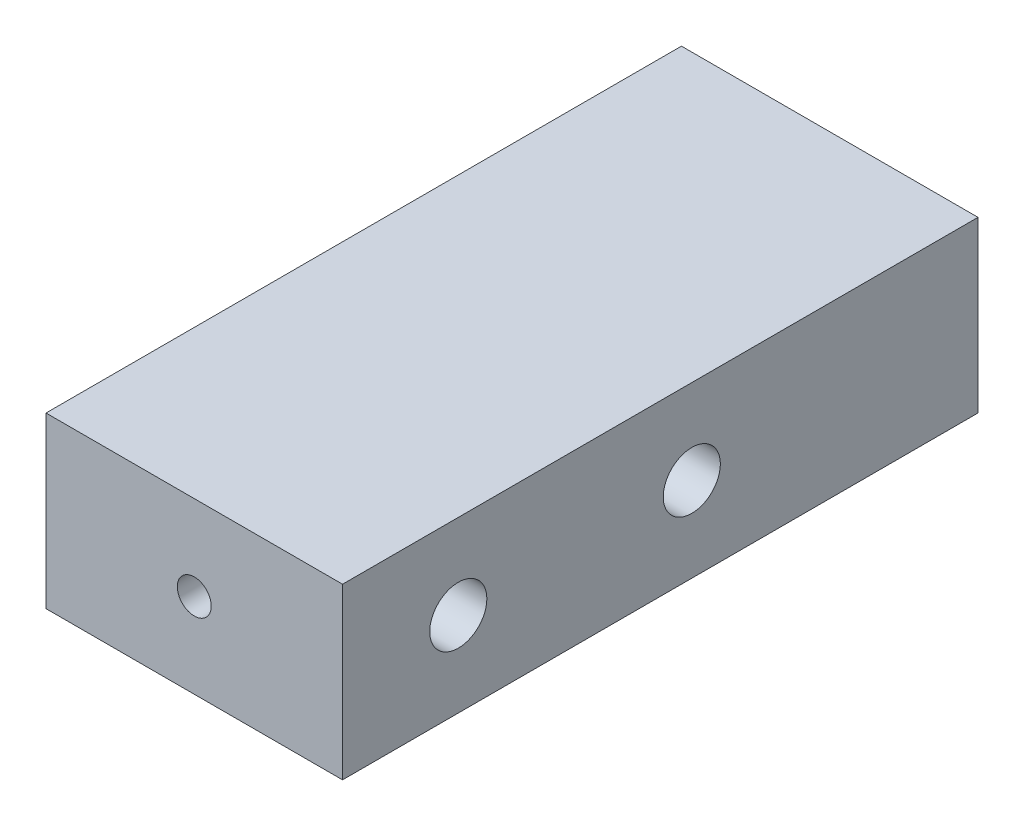
ISO-10303-21;
HEADER;
FILE_DESCRIPTION(('STEP AP214'),'2;1');
FILE_NAME('part.step','',(''),(''),'','','');
FILE_SCHEMA(('AUTOMOTIVE_DESIGN { 1 0 10303 214 1 1 1 1 }'));
ENDSEC;
DATA;
#1=APPLICATION_CONTEXT('core data for automotive mechanical design processes');
#2=APPLICATION_PROTOCOL_DEFINITION('international standard','automotive_design',2000,#1);
#3=PRODUCT_CONTEXT('',#1,'mechanical');
#4=PRODUCT('Part','Part','',(#3));
#5=PRODUCT_RELATED_PRODUCT_CATEGORY('part','',(#4));
#6=PRODUCT_DEFINITION_FORMATION('','',#4);
#7=PRODUCT_DEFINITION_CONTEXT('part definition',#1,'design');
#8=PRODUCT_DEFINITION('design','',#6,#7);
#9=PRODUCT_DEFINITION_SHAPE('','',#8);
#10=(LENGTH_UNIT() NAMED_UNIT(*) SI_UNIT(.MILLI.,.METRE.));
#11=(NAMED_UNIT(*) PLANE_ANGLE_UNIT() SI_UNIT($,.RADIAN.));
#12=(NAMED_UNIT(*) SI_UNIT($,.STERADIAN.) SOLID_ANGLE_UNIT());
#13=UNCERTAINTY_MEASURE_WITH_UNIT(LENGTH_MEASURE(1.E-05),#10,'distance_accuracy_value','');
#14=(GEOMETRIC_REPRESENTATION_CONTEXT(3) GLOBAL_UNCERTAINTY_ASSIGNED_CONTEXT((#13)) GLOBAL_UNIT_ASSIGNED_CONTEXT((#10,
#11,#12)) REPRESENTATION_CONTEXT('',''));
#15=CARTESIAN_POINT('',(0.,0.,0.));
#16=DIRECTION('',(0.,0.,1.));
#17=DIRECTION('',(1.,0.,0.));
#18=AXIS2_PLACEMENT_3D('',#15,#16,#17);
#19=CARTESIAN_POINT('',(0.,25.4,95.25));
#20=DIRECTION('',(1.,0.,0.));
#21=DIRECTION('',(0.,0.,-1.));
#22=AXIS2_PLACEMENT_3D('',#19,#20,#21);
#23=PLANE('',#22);
#24=CARTESIAN_POINT('',(0.,12.7,25.4));
#25=DIRECTION('',(-1.,0.,0.));
#26=DIRECTION('',(0.,-1.,0.));
#27=AXIS2_PLACEMENT_3D('',#24,#25,#26);
#28=CIRCLE('',#27,4.28);
#29=CARTESIAN_POINT('',(0.,8.42,25.4));
#30=VERTEX_POINT('',#29);
#31=EDGE_CURVE('E159',#30,#30,#28,.T.);
#32=ORIENTED_EDGE('',*,*,#31,.F.);
#33=EDGE_LOOP('',(#32));
#34=FACE_BOUND('',#33,.T.);
#35=CARTESIAN_POINT('',(0.,12.7,60.4));
#36=DIRECTION('',(-1.,0.,0.));
#37=DIRECTION('',(0.,-1.,0.));
#38=AXIS2_PLACEMENT_3D('',#35,#36,#37);
#39=CIRCLE('',#38,4.28000000000001);
#40=CARTESIAN_POINT('',(0.,8.41999999999999,60.4));
#41=VERTEX_POINT('',#40);
#42=EDGE_CURVE('E162',#41,#41,#39,.T.);
#43=ORIENTED_EDGE('',*,*,#42,.F.);
#44=EDGE_LOOP('',(#43));
#45=FACE_BOUND('',#44,.T.);
#46=DIRECTION('',(0.,-1.,0.));
#47=VECTOR('',#46,1.);
#48=CARTESIAN_POINT('',(0.,25.4,0.));
#49=LINE('',#48,#47);
#50=CARTESIAN_POINT('',(0.,25.4,0.));
#51=VERTEX_POINT('',#50);
#52=CARTESIAN_POINT('',(0.,0.,0.));
#53=VERTEX_POINT('',#52);
#54=EDGE_CURVE('E158',#51,#53,#49,.T.);
#55=ORIENTED_EDGE('',*,*,#54,.T.);
#56=DIRECTION('',(0.,0.,-1.));
#57=VECTOR('',#56,1.);
#58=CARTESIAN_POINT('',(0.,0.,95.25));
#59=LINE('',#58,#57);
#60=CARTESIAN_POINT('',(0.,0.,95.25));
#61=VERTEX_POINT('',#60);
#62=EDGE_CURVE('E11',#61,#53,#59,.T.);
#63=ORIENTED_EDGE('',*,*,#62,.F.);
#64=DIRECTION('',(0.,-1.,0.));
#65=VECTOR('',#64,1.);
#66=CARTESIAN_POINT('',(0.,25.4,95.25));
#67=LINE('',#66,#65);
#68=CARTESIAN_POINT('',(0.,25.4,95.25));
#69=VERTEX_POINT('',#68);
#70=EDGE_CURVE('E167',#69,#61,#67,.T.);
#71=ORIENTED_EDGE('',*,*,#70,.F.);
#72=DIRECTION('',(0.,0.,-1.));
#73=VECTOR('',#72,1.);
#74=CARTESIAN_POINT('',(0.,25.4,95.25));
#75=LINE('',#74,#73);
#76=EDGE_CURVE('E177',#69,#51,#75,.T.);
#77=ORIENTED_EDGE('',*,*,#76,.T.);
#78=EDGE_LOOP('',(#55,#63,#71,#77));
#79=FACE_BOUND('',#78,.T.);
#80=ADVANCED_FACE('F39',(#34,#45,#79),#23,.F.);
#81=CARTESIAN_POINT('',(0.,0.,95.25));
#82=DIRECTION('',(0.,1.,0.));
#83=DIRECTION('',(0.,0.,1.));
#84=AXIS2_PLACEMENT_3D('',#81,#82,#83);
#85=PLANE('',#84);
#86=DIRECTION('',(1.,0.,0.));
#87=VECTOR('',#86,1.);
#88=CARTESIAN_POINT('',(0.,0.,0.));
#89=LINE('',#88,#87);
#90=CARTESIAN_POINT('',(44.45,0.,0.));
#91=VERTEX_POINT('',#90);
#92=EDGE_CURVE('E180',#53,#91,#89,.T.);
#93=ORIENTED_EDGE('',*,*,#92,.T.);
#94=DIRECTION('',(0.,0.,-1.));
#95=VECTOR('',#94,1.);
#96=CARTESIAN_POINT('',(44.45,0.,95.25));
#97=LINE('',#96,#95);
#98=CARTESIAN_POINT('',(44.45,0.,95.25));
#99=VERTEX_POINT('',#98);
#100=EDGE_CURVE('E47',#99,#91,#97,.T.);
#101=ORIENTED_EDGE('',*,*,#100,.F.);
#102=DIRECTION('',(1.,0.,0.));
#103=VECTOR('',#102,1.);
#104=CARTESIAN_POINT('',(0.,0.,95.25));
#105=LINE('',#104,#103);
#106=EDGE_CURVE('E170',#61,#99,#105,.T.);
#107=ORIENTED_EDGE('',*,*,#106,.F.);
#108=ORIENTED_EDGE('',*,*,#62,.T.);
#109=EDGE_LOOP('',(#93,#101,#107,#108));
#110=FACE_BOUND('',#109,.T.);
#111=ADVANCED_FACE('F211',(#110),#85,.F.);
#112=CARTESIAN_POINT('',(44.45,25.4,95.25));
#113=DIRECTION('',(-1.,0.,0.));
#114=DIRECTION('',(0.,0.,1.));
#115=AXIS2_PLACEMENT_3D('',#112,#113,#114);
#116=PLANE('',#115);
#117=CARTESIAN_POINT('',(44.45,12.7,77.9));
#118=DIRECTION('',(1.,0.,0.));
#119=DIRECTION('',(0.,0.,-1.));
#120=AXIS2_PLACEMENT_3D('',#117,#118,#119);
#121=CIRCLE('',#120,4.28000000000001);
#122=CARTESIAN_POINT('',(44.45,12.7,73.62));
#123=VERTEX_POINT('',#122);
#124=EDGE_CURVE('E147',#123,#123,#121,.T.);
#125=ORIENTED_EDGE('',*,*,#124,.F.);
#126=EDGE_LOOP('',(#125));
#127=FACE_BOUND('',#126,.T.);
#128=CARTESIAN_POINT('',(44.45,12.7,42.9));
#129=DIRECTION('',(1.,0.,0.));
#130=DIRECTION('',(0.,0.,-1.));
#131=AXIS2_PLACEMENT_3D('',#128,#129,#130);
#132=CIRCLE('',#131,4.28);
#133=CARTESIAN_POINT('',(44.45,12.7,38.62));
#134=VERTEX_POINT('',#133);
#135=EDGE_CURVE('E150',#134,#134,#132,.T.);
#136=ORIENTED_EDGE('',*,*,#135,.F.);
#137=EDGE_LOOP('',(#136));
#138=FACE_BOUND('',#137,.T.);
#139=DIRECTION('',(0.,1.,0.));
#140=VECTOR('',#139,1.);
#141=CARTESIAN_POINT('',(44.45,25.4,0.));
#142=LINE('',#141,#140);
#143=CARTESIAN_POINT('',(44.45,25.4,0.));
#144=VERTEX_POINT('',#143);
#145=EDGE_CURVE('E182',#91,#144,#142,.T.);
#146=ORIENTED_EDGE('',*,*,#145,.T.);
#147=DIRECTION('',(0.,0.,-1.));
#148=VECTOR('',#147,1.);
#149=CARTESIAN_POINT('',(44.45,25.4,95.25));
#150=LINE('',#149,#148);
#151=CARTESIAN_POINT('',(44.45,25.4,95.25));
#152=VERTEX_POINT('',#151);
#153=EDGE_CURVE('E187',#152,#144,#150,.T.);
#154=ORIENTED_EDGE('',*,*,#153,.F.);
#155=DIRECTION('',(0.,1.,0.));
#156=VECTOR('',#155,1.);
#157=CARTESIAN_POINT('',(44.45,25.4,95.25));
#158=LINE('',#157,#156);
#159=EDGE_CURVE('E173',#99,#152,#158,.T.);
#160=ORIENTED_EDGE('',*,*,#159,.F.);
#161=ORIENTED_EDGE('',*,*,#100,.T.);
#162=EDGE_LOOP('',(#146,#154,#160,#161));
#163=FACE_BOUND('',#162,.T.);
#164=ADVANCED_FACE('F195',(#127,#138,#163),#116,.F.);
#165=CARTESIAN_POINT('',(0.,25.4,95.25));
#166=DIRECTION('',(0.,-1.,0.));
#167=DIRECTION('',(0.,0.,-1.));
#168=AXIS2_PLACEMENT_3D('',#165,#166,#167);
#169=PLANE('',#168);
#170=DIRECTION('',(-1.,0.,0.));
#171=VECTOR('',#170,1.);
#172=CARTESIAN_POINT('',(0.,25.4,0.));
#173=LINE('',#172,#171);
#174=EDGE_CURVE('E171',#144,#51,#173,.T.);
#175=ORIENTED_EDGE('',*,*,#174,.T.);
#176=ORIENTED_EDGE('',*,*,#76,.F.);
#177=DIRECTION('',(-1.,0.,0.));
#178=VECTOR('',#177,1.);
#179=CARTESIAN_POINT('',(0.,25.4,95.25));
#180=LINE('',#179,#178);
#181=EDGE_CURVE('E175',#152,#69,#180,.T.);
#182=ORIENTED_EDGE('',*,*,#181,.F.);
#183=ORIENTED_EDGE('',*,*,#153,.T.);
#184=EDGE_LOOP('',(#175,#176,#182,#183));
#185=FACE_BOUND('',#184,.T.);
#186=ADVANCED_FACE('F204',(#185),#169,.F.);
#187=CARTESIAN_POINT('',(0.,0.,95.25));
#188=DIRECTION('',(0.,0.,1.));
#189=DIRECTION('',(1.,0.,0.));
#190=AXIS2_PLACEMENT_3D('',#187,#188,#189);
#191=PLANE('',#190);
#192=CARTESIAN_POINT('',(22.225,12.7,95.25));
#193=DIRECTION('',(0.,0.,1.));
#194=DIRECTION('',(1.,0.,0.));
#195=AXIS2_PLACEMENT_3D('',#192,#193,#194);
#196=CIRCLE('',#195,2.54);
#197=CARTESIAN_POINT('',(24.765,12.7,95.25));
#198=VERTEX_POINT('',#197);
#199=EDGE_CURVE('E42',#198,#198,#196,.T.);
#200=ORIENTED_EDGE('',*,*,#199,.F.);
#201=EDGE_LOOP('',(#200));
#202=FACE_BOUND('',#201,.T.);
#203=ORIENTED_EDGE('',*,*,#70,.T.);
#204=ORIENTED_EDGE('',*,*,#106,.T.);
#205=ORIENTED_EDGE('',*,*,#159,.T.);
#206=ORIENTED_EDGE('',*,*,#181,.T.);
#207=EDGE_LOOP('',(#203,#204,#205,#206));
#208=FACE_BOUND('',#207,.T.);
#209=ADVANCED_FACE('F210',(#202,#208),#191,.T.);
#210=CARTESIAN_POINT('',(0.,0.,0.));
#211=DIRECTION('',(0.,0.,1.));
#212=DIRECTION('',(1.,0.,0.));
#213=AXIS2_PLACEMENT_3D('',#210,#211,#212);
#214=PLANE('',#213);
#215=CARTESIAN_POINT('',(22.225,12.7,0.));
#216=DIRECTION('',(0.,0.,-1.));
#217=DIRECTION('',(-1.,0.,0.));
#218=AXIS2_PLACEMENT_3D('',#215,#216,#217);
#219=CIRCLE('',#218,4.2799);
#220=CARTESIAN_POINT('',(17.9451,12.7,0.));
#221=VERTEX_POINT('',#220);
#222=EDGE_CURVE('E140',#221,#221,#219,.T.);
#223=ORIENTED_EDGE('',*,*,#222,.F.);
#224=EDGE_LOOP('',(#223));
#225=FACE_BOUND('',#224,.T.);
#226=ORIENTED_EDGE('',*,*,#54,.F.);
#227=ORIENTED_EDGE('',*,*,#174,.F.);
#228=ORIENTED_EDGE('',*,*,#145,.F.);
#229=ORIENTED_EDGE('',*,*,#92,.F.);
#230=EDGE_LOOP('',(#226,#227,#228,#229));
#231=FACE_BOUND('',#230,.T.);
#232=ADVANCED_FACE('F201',(#225,#231),#214,.F.);
#233=CARTESIAN_POINT('',(14.224,12.7,60.4));
#234=DIRECTION('',(-1.,0.,0.));
#235=DIRECTION('',(0.,-1.,0.));
#236=AXIS2_PLACEMENT_3D('',#233,#234,#235);
#237=CYLINDRICAL_SURFACE('',#236,4.28000000000001);
#238=CARTESIAN_POINT('',(14.224,12.7,60.4));
#239=DIRECTION('',(-1.,0.,0.));
#240=DIRECTION('',(0.,-1.,0.));
#241=AXIS2_PLACEMENT_3D('',#238,#239,#240);
#242=CIRCLE('',#241,4.28000000000001);
#243=CARTESIAN_POINT('',(14.224,8.41999999999999,60.4));
#244=VERTEX_POINT('',#243);
#245=EDGE_CURVE('E146',#244,#244,#242,.T.);
#246=ORIENTED_EDGE('',*,*,#245,.F.);
#247=EDGE_LOOP('',(#246));
#248=FACE_BOUND('',#247,.T.);
#249=ORIENTED_EDGE('',*,*,#42,.T.);
#250=EDGE_LOOP('',(#249));
#251=FACE_BOUND('',#250,.T.);
#252=ADVANCED_FACE('F225',(#248,#251),#237,.F.);
#253=CARTESIAN_POINT('',(14.224,12.7,60.4));
#254=DIRECTION('',(-1.,0.,0.));
#255=DIRECTION('',(0.,-1.,0.));
#256=AXIS2_PLACEMENT_3D('',#253,#254,#255);
#257=PLANE('',#256);
#258=CARTESIAN_POINT('',(14.224,12.7,60.4));
#259=DIRECTION('',(-1.,0.,0.));
#260=DIRECTION('',(0.,-1.,0.));
#261=AXIS2_PLACEMENT_3D('',#258,#259,#260);
#262=CIRCLE('',#261,2.54);
#263=CARTESIAN_POINT('',(14.224,10.16,60.4));
#264=VERTEX_POINT('',#263);
#265=EDGE_CURVE('E116',#264,#264,#262,.T.);
#266=ORIENTED_EDGE('',*,*,#265,.F.);
#267=EDGE_LOOP('',(#266));
#268=FACE_BOUND('',#267,.T.);
#269=ORIENTED_EDGE('',*,*,#245,.T.);
#270=EDGE_LOOP('',(#269));
#271=FACE_BOUND('',#270,.T.);
#272=ADVANCED_FACE('F230',(#268,#271),#257,.T.);
#273=CARTESIAN_POINT('',(14.224,12.7,25.4));
#274=DIRECTION('',(-1.,0.,0.));
#275=DIRECTION('',(0.,-1.,0.));
#276=AXIS2_PLACEMENT_3D('',#273,#274,#275);
#277=CYLINDRICAL_SURFACE('',#276,4.28);
#278=CARTESIAN_POINT('',(14.224,12.7,25.4));
#279=DIRECTION('',(-1.,0.,0.));
#280=DIRECTION('',(0.,-1.,0.));
#281=AXIS2_PLACEMENT_3D('',#278,#279,#280);
#282=CIRCLE('',#281,4.28);
#283=CARTESIAN_POINT('',(14.224,8.42,25.4));
#284=VERTEX_POINT('',#283);
#285=EDGE_CURVE('E155',#284,#284,#282,.T.);
#286=ORIENTED_EDGE('',*,*,#285,.F.);
#287=EDGE_LOOP('',(#286));
#288=FACE_BOUND('',#287,.T.);
#289=ORIENTED_EDGE('',*,*,#31,.T.);
#290=EDGE_LOOP('',(#289));
#291=FACE_BOUND('',#290,.T.);
#292=ADVANCED_FACE('F233',(#288,#291),#277,.F.);
#293=CARTESIAN_POINT('',(14.224,12.7,25.4));
#294=DIRECTION('',(-1.,0.,0.));
#295=DIRECTION('',(0.,-1.,0.));
#296=AXIS2_PLACEMENT_3D('',#293,#294,#295);
#297=PLANE('',#296);
#298=CARTESIAN_POINT('',(14.224,12.7,25.4));
#299=DIRECTION('',(-1.,0.,0.));
#300=DIRECTION('',(0.,-1.,0.));
#301=AXIS2_PLACEMENT_3D('',#298,#299,#300);
#302=CIRCLE('',#301,2.54);
#303=CARTESIAN_POINT('',(14.224,10.16,25.4));
#304=VERTEX_POINT('',#303);
#305=EDGE_CURVE('E109',#304,#304,#302,.T.);
#306=ORIENTED_EDGE('',*,*,#305,.F.);
#307=EDGE_LOOP('',(#306));
#308=FACE_BOUND('',#307,.T.);
#309=ORIENTED_EDGE('',*,*,#285,.T.);
#310=EDGE_LOOP('',(#309));
#311=FACE_BOUND('',#310,.T.);
#312=ADVANCED_FACE('F240',(#308,#311),#297,.T.);
#313=CARTESIAN_POINT('',(30.226,12.7,42.9));
#314=DIRECTION('',(1.,0.,0.));
#315=DIRECTION('',(0.,0.,-1.));
#316=AXIS2_PLACEMENT_3D('',#313,#314,#315);
#317=CYLINDRICAL_SURFACE('',#316,4.28);
#318=CARTESIAN_POINT('',(30.226,12.7,42.9));
#319=DIRECTION('',(1.,0.,0.));
#320=DIRECTION('',(0.,0.,-1.));
#321=AXIS2_PLACEMENT_3D('',#318,#319,#320);
#322=CIRCLE('',#321,4.28);
#323=CARTESIAN_POINT('',(30.226,12.7,38.62));
#324=VERTEX_POINT('',#323);
#325=EDGE_CURVE('E139',#324,#324,#322,.T.);
#326=ORIENTED_EDGE('',*,*,#325,.F.);
#327=EDGE_LOOP('',(#326));
#328=FACE_BOUND('',#327,.T.);
#329=ORIENTED_EDGE('',*,*,#135,.T.);
#330=EDGE_LOOP('',(#329));
#331=FACE_BOUND('',#330,.T.);
#332=ADVANCED_FACE('F244',(#328,#331),#317,.F.);
#333=CARTESIAN_POINT('',(30.226,12.7,42.9));
#334=DIRECTION('',(1.,0.,0.));
#335=DIRECTION('',(0.,0.,-1.));
#336=AXIS2_PLACEMENT_3D('',#333,#334,#335);
#337=PLANE('',#336);
#338=CARTESIAN_POINT('',(30.226,12.7,42.9));
#339=DIRECTION('',(1.,0.,0.));
#340=DIRECTION('',(0.,0.,-1.));
#341=AXIS2_PLACEMENT_3D('',#338,#339,#340);
#342=CIRCLE('',#341,2.54);
#343=CARTESIAN_POINT('',(30.226,12.7,40.36));
#344=VERTEX_POINT('',#343);
#345=EDGE_CURVE('E120',#344,#344,#342,.T.);
#346=ORIENTED_EDGE('',*,*,#345,.F.);
#347=EDGE_LOOP('',(#346));
#348=FACE_BOUND('',#347,.T.);
#349=ORIENTED_EDGE('',*,*,#325,.T.);
#350=EDGE_LOOP('',(#349));
#351=FACE_BOUND('',#350,.T.);
#352=ADVANCED_FACE('F246',(#348,#351),#337,.T.);
#353=CARTESIAN_POINT('',(30.226,12.7,77.9));
#354=DIRECTION('',(1.,0.,0.));
#355=DIRECTION('',(0.,0.,-1.));
#356=AXIS2_PLACEMENT_3D('',#353,#354,#355);
#357=CYLINDRICAL_SURFACE('',#356,4.28000000000001);
#358=CARTESIAN_POINT('',(30.226,12.7,77.9));
#359=DIRECTION('',(1.,0.,0.));
#360=DIRECTION('',(0.,0.,-1.));
#361=AXIS2_PLACEMENT_3D('',#358,#359,#360);
#362=CIRCLE('',#361,4.28000000000001);
#363=CARTESIAN_POINT('',(30.226,12.7,73.62));
#364=VERTEX_POINT('',#363);
#365=EDGE_CURVE('E143',#364,#364,#362,.T.);
#366=ORIENTED_EDGE('',*,*,#365,.F.);
#367=EDGE_LOOP('',(#366));
#368=FACE_BOUND('',#367,.T.);
#369=ORIENTED_EDGE('',*,*,#124,.T.);
#370=EDGE_LOOP('',(#369));
#371=FACE_BOUND('',#370,.T.);
#372=ADVANCED_FACE('F249',(#368,#371),#357,.F.);
#373=CARTESIAN_POINT('',(30.226,12.7,77.9));
#374=DIRECTION('',(1.,0.,0.));
#375=DIRECTION('',(0.,0.,-1.));
#376=AXIS2_PLACEMENT_3D('',#373,#374,#375);
#377=PLANE('',#376);
#378=CARTESIAN_POINT('',(30.226,12.7,77.9));
#379=DIRECTION('',(1.,0.,0.));
#380=DIRECTION('',(0.,0.,-1.));
#381=AXIS2_PLACEMENT_3D('',#378,#379,#380);
#382=CIRCLE('',#381,2.54);
#383=CARTESIAN_POINT('',(30.226,12.7,75.36));
#384=VERTEX_POINT('',#383);
#385=EDGE_CURVE('E112',#384,#384,#382,.T.);
#386=ORIENTED_EDGE('',*,*,#385,.F.);
#387=EDGE_LOOP('',(#386));
#388=FACE_BOUND('',#387,.T.);
#389=ORIENTED_EDGE('',*,*,#365,.T.);
#390=EDGE_LOOP('',(#389));
#391=FACE_BOUND('',#390,.T.);
#392=ADVANCED_FACE('F256',(#388,#391),#377,.T.);
#393=CARTESIAN_POINT('',(22.225,12.7,14.224));
#394=DIRECTION('',(0.,0.,-1.));
#395=DIRECTION('',(-1.,0.,0.));
#396=AXIS2_PLACEMENT_3D('',#393,#394,#395);
#397=CYLINDRICAL_SURFACE('',#396,4.2799);
#398=CARTESIAN_POINT('',(22.225,12.7,14.224));
#399=DIRECTION('',(0.,0.,-1.));
#400=DIRECTION('',(-1.,0.,0.));
#401=AXIS2_PLACEMENT_3D('',#398,#399,#400);
#402=CIRCLE('',#401,4.2799);
#403=CARTESIAN_POINT('',(17.9451,12.7,14.224));
#404=VERTEX_POINT('',#403);
#405=EDGE_CURVE('E136',#404,#404,#402,.T.);
#406=ORIENTED_EDGE('',*,*,#405,.F.);
#407=EDGE_LOOP('',(#406));
#408=FACE_BOUND('',#407,.T.);
#409=ORIENTED_EDGE('',*,*,#222,.T.);
#410=EDGE_LOOP('',(#409));
#411=FACE_BOUND('',#410,.T.);
#412=ADVANCED_FACE('F260',(#408,#411),#397,.F.);
#413=CARTESIAN_POINT('',(22.225,12.7,14.224));
#414=DIRECTION('',(0.,0.,-1.));
#415=DIRECTION('',(-1.,0.,0.));
#416=AXIS2_PLACEMENT_3D('',#413,#414,#415);
#417=PLANE('',#416);
#418=CARTESIAN_POINT('',(22.225,12.7,14.224));
#419=DIRECTION('',(0.,0.,-1.));
#420=DIRECTION('',(-1.,0.,0.));
#421=AXIS2_PLACEMENT_3D('',#418,#419,#420);
#422=CIRCLE('',#421,2.54);
#423=CARTESIAN_POINT('',(19.685,12.7,14.224));
#424=VERTEX_POINT('',#423);
#425=EDGE_CURVE('E123',#424,#424,#422,.T.);
#426=ORIENTED_EDGE('',*,*,#425,.F.);
#427=EDGE_LOOP('',(#426));
#428=FACE_BOUND('',#427,.T.);
#429=ORIENTED_EDGE('',*,*,#405,.T.);
#430=EDGE_LOOP('',(#429));
#431=FACE_BOUND('',#430,.T.);
#432=ADVANCED_FACE('F264',(#428,#431),#417,.T.);
#433=CARTESIAN_POINT('',(22.225,12.7,100.584));
#434=DIRECTION('',(0.,0.,-1.));
#435=DIRECTION('',(-1.,0.,0.));
#436=AXIS2_PLACEMENT_3D('',#433,#434,#435);
#437=CYLINDRICAL_SURFACE('',#436,2.54);
#438=CARTESIAN_POINT('',(22.225,12.7,25.4));
#439=DIRECTION('',(-0.707106781186547,0.,0.707106781186548));
#440=DIRECTION('',(-0.707106781186547,0.,-0.707106781186548));
#441=AXIS2_PLACEMENT_3D('',#438,#439,#440);
#442=ELLIPSE('',#441,3.59210244842766,2.54);
#443=CARTESIAN_POINT('',(22.225,10.16,25.4));
#444=VERTEX_POINT('',#443);
#445=CARTESIAN_POINT('',(22.225,15.24,25.4));
#446=VERTEX_POINT('',#445);
#447=EDGE_CURVE('E101',#444,#446,#442,.F.);
#448=ORIENTED_EDGE('',*,*,#447,.F.);
#449=CARTESIAN_POINT('',(22.225,12.7,25.4));
#450=DIRECTION('',(-0.707106781186547,0.,-0.707106781186548));
#451=DIRECTION('',(-0.707106781186547,0.,0.707106781186548));
#452=AXIS2_PLACEMENT_3D('',#449,#450,#451);
#453=ELLIPSE('',#452,3.59210244842766,2.54);
#454=EDGE_CURVE('E53',#446,#444,#453,.F.);
#455=ORIENTED_EDGE('',*,*,#454,.F.);
#456=EDGE_LOOP('',(#448,#455));
#457=FACE_BOUND('',#456,.T.);
#458=CARTESIAN_POINT('',(22.225,12.7,60.4));
#459=DIRECTION('',(-0.707106781186547,0.,0.707106781186548));
#460=DIRECTION('',(-0.707106781186547,0.,-0.707106781186548));
#461=AXIS2_PLACEMENT_3D('',#458,#459,#460);
#462=ELLIPSE('',#461,3.59210244842766,2.54);
#463=CARTESIAN_POINT('',(22.225,10.16,60.4));
#464=VERTEX_POINT('',#463);
#465=CARTESIAN_POINT('',(22.225,15.24,60.4));
#466=VERTEX_POINT('',#465);
#467=EDGE_CURVE('E105',#464,#466,#462,.F.);
#468=ORIENTED_EDGE('',*,*,#467,.F.);
#469=CARTESIAN_POINT('',(22.225,12.7,60.4));
#470=DIRECTION('',(-0.707106781186547,0.,-0.707106781186548));
#471=DIRECTION('',(-0.707106781186547,0.,0.707106781186548));
#472=AXIS2_PLACEMENT_3D('',#469,#470,#471);
#473=ELLIPSE('',#472,3.59210244842766,2.54);
#474=EDGE_CURVE('E60',#466,#464,#473,.F.);
#475=ORIENTED_EDGE('',*,*,#474,.F.);
#476=EDGE_LOOP('',(#468,#475));
#477=FACE_BOUND('',#476,.T.);
#478=CARTESIAN_POINT('',(22.225,12.7,42.9));
#479=DIRECTION('',(0.707106781186547,0.,0.707106781186548));
#480=DIRECTION('',(0.707106781186547,0.,-0.707106781186548));
#481=AXIS2_PLACEMENT_3D('',#478,#479,#480);
#482=ELLIPSE('',#481,3.59210244842766,2.54);
#483=CARTESIAN_POINT('',(22.225,15.24,42.9));
#484=VERTEX_POINT('',#483);
#485=CARTESIAN_POINT('',(22.225,10.16,42.9));
#486=VERTEX_POINT('',#485);
#487=EDGE_CURVE('E125',#484,#486,#482,.F.);
#488=ORIENTED_EDGE('',*,*,#487,.F.);
#489=CARTESIAN_POINT('',(22.225,12.7,42.9));
#490=DIRECTION('',(0.707106781186547,0.,-0.707106781186548));
#491=DIRECTION('',(0.707106781186547,0.,0.707106781186548));
#492=AXIS2_PLACEMENT_3D('',#489,#490,#491);
#493=ELLIPSE('',#492,3.59210244842766,2.54);
#494=EDGE_CURVE('E124',#486,#484,#493,.F.);
#495=ORIENTED_EDGE('',*,*,#494,.F.);
#496=EDGE_LOOP('',(#488,#495));
#497=FACE_BOUND('',#496,.T.);
#498=CARTESIAN_POINT('',(22.225,12.7,77.9));
#499=DIRECTION('',(0.707106781186547,0.,0.707106781186548));
#500=DIRECTION('',(0.707106781186547,0.,-0.707106781186548));
#501=AXIS2_PLACEMENT_3D('',#498,#499,#500);
#502=ELLIPSE('',#501,3.59210244842766,2.54);
#503=CARTESIAN_POINT('',(22.225,15.24,77.9));
#504=VERTEX_POINT('',#503);
#505=CARTESIAN_POINT('',(22.225,10.16,77.9));
#506=VERTEX_POINT('',#505);
#507=EDGE_CURVE('E127',#504,#506,#502,.F.);
#508=ORIENTED_EDGE('',*,*,#507,.F.);
#509=CARTESIAN_POINT('',(22.225,12.7,77.9));
#510=DIRECTION('',(0.707106781186547,0.,-0.707106781186548));
#511=DIRECTION('',(0.707106781186547,0.,0.707106781186548));
#512=AXIS2_PLACEMENT_3D('',#509,#510,#511);
#513=ELLIPSE('',#512,3.59210244842766,2.54);
#514=EDGE_CURVE('E129',#506,#504,#513,.F.);
#515=ORIENTED_EDGE('',*,*,#514,.F.);
#516=EDGE_LOOP('',(#508,#515));
#517=FACE_BOUND('',#516,.T.);
#518=ORIENTED_EDGE('',*,*,#199,.T.);
#519=EDGE_LOOP('',(#518));
#520=FACE_BOUND('',#519,.T.);
#521=ORIENTED_EDGE('',*,*,#425,.T.);
#522=EDGE_LOOP('',(#521));
#523=FACE_BOUND('',#522,.T.);
#524=ADVANCED_FACE('F107',(#457,#477,#497,#517,#520,#523),#437,.F.);
#525=CARTESIAN_POINT('',(-0.001000000000001,12.7,77.9));
#526=DIRECTION('',(1.,0.,0.));
#527=DIRECTION('',(0.,0.,-1.));
#528=AXIS2_PLACEMENT_3D('',#525,#526,#527);
#529=CYLINDRICAL_SURFACE('',#528,2.54);
#530=ORIENTED_EDGE('',*,*,#514,.T.);
#531=ORIENTED_EDGE('',*,*,#507,.T.);
#532=EDGE_LOOP('',(#530,#531));
#533=FACE_BOUND('',#532,.T.);
#534=ORIENTED_EDGE('',*,*,#385,.T.);
#535=EDGE_LOOP('',(#534));
#536=FACE_BOUND('',#535,.T.);
#537=ADVANCED_FACE('F271',(#533,#536),#529,.F.);
#538=CARTESIAN_POINT('',(-0.001000000000001,12.7,42.9));
#539=DIRECTION('',(1.,0.,0.));
#540=DIRECTION('',(0.,0.,-1.));
#541=AXIS2_PLACEMENT_3D('',#538,#539,#540);
#542=CYLINDRICAL_SURFACE('',#541,2.54);
#543=ORIENTED_EDGE('',*,*,#494,.T.);
#544=ORIENTED_EDGE('',*,*,#487,.T.);
#545=EDGE_LOOP('',(#543,#544));
#546=FACE_BOUND('',#545,.T.);
#547=ORIENTED_EDGE('',*,*,#345,.T.);
#548=EDGE_LOOP('',(#547));
#549=FACE_BOUND('',#548,.T.);
#550=ADVANCED_FACE('F274',(#546,#549),#542,.F.);
#551=CARTESIAN_POINT('',(44.451,12.7,60.4));
#552=DIRECTION('',(-1.,0.,0.));
#553=DIRECTION('',(0.,-1.,0.));
#554=AXIS2_PLACEMENT_3D('',#551,#552,#553);
#555=CYLINDRICAL_SURFACE('',#554,2.54);
#556=ORIENTED_EDGE('',*,*,#474,.T.);
#557=ORIENTED_EDGE('',*,*,#467,.T.);
#558=EDGE_LOOP('',(#556,#557));
#559=FACE_BOUND('',#558,.T.);
#560=ORIENTED_EDGE('',*,*,#265,.T.);
#561=EDGE_LOOP('',(#560));
#562=FACE_BOUND('',#561,.T.);
#563=ADVANCED_FACE('F278',(#559,#562),#555,.F.);
#564=CARTESIAN_POINT('',(44.451,12.7,25.4));
#565=DIRECTION('',(-1.,0.,0.));
#566=DIRECTION('',(0.,-1.,0.));
#567=AXIS2_PLACEMENT_3D('',#564,#565,#566);
#568=CYLINDRICAL_SURFACE('',#567,2.54);
#569=ORIENTED_EDGE('',*,*,#454,.T.);
#570=ORIENTED_EDGE('',*,*,#447,.T.);
#571=EDGE_LOOP('',(#569,#570));
#572=FACE_BOUND('',#571,.T.);
#573=ORIENTED_EDGE('',*,*,#305,.T.);
#574=EDGE_LOOP('',(#573));
#575=FACE_BOUND('',#574,.T.);
#576=ADVANCED_FACE('F102',(#572,#575),#568,.F.);
#577=CLOSED_SHELL('',(#80,#111,#164,#186,#209,#232,#252,#272,#292,#312,#332,#352,#372,#392,#412,
#432,#524,#537,#550,#563,#576));
#578=MANIFOLD_SOLID_BREP('B2',#577);
#579=ADVANCED_BREP_SHAPE_REPRESENTATION('',(#18,#578),#14);
#580=SHAPE_DEFINITION_REPRESENTATION(#9,#579);
ENDSEC;
END-ISO-10303-21;
